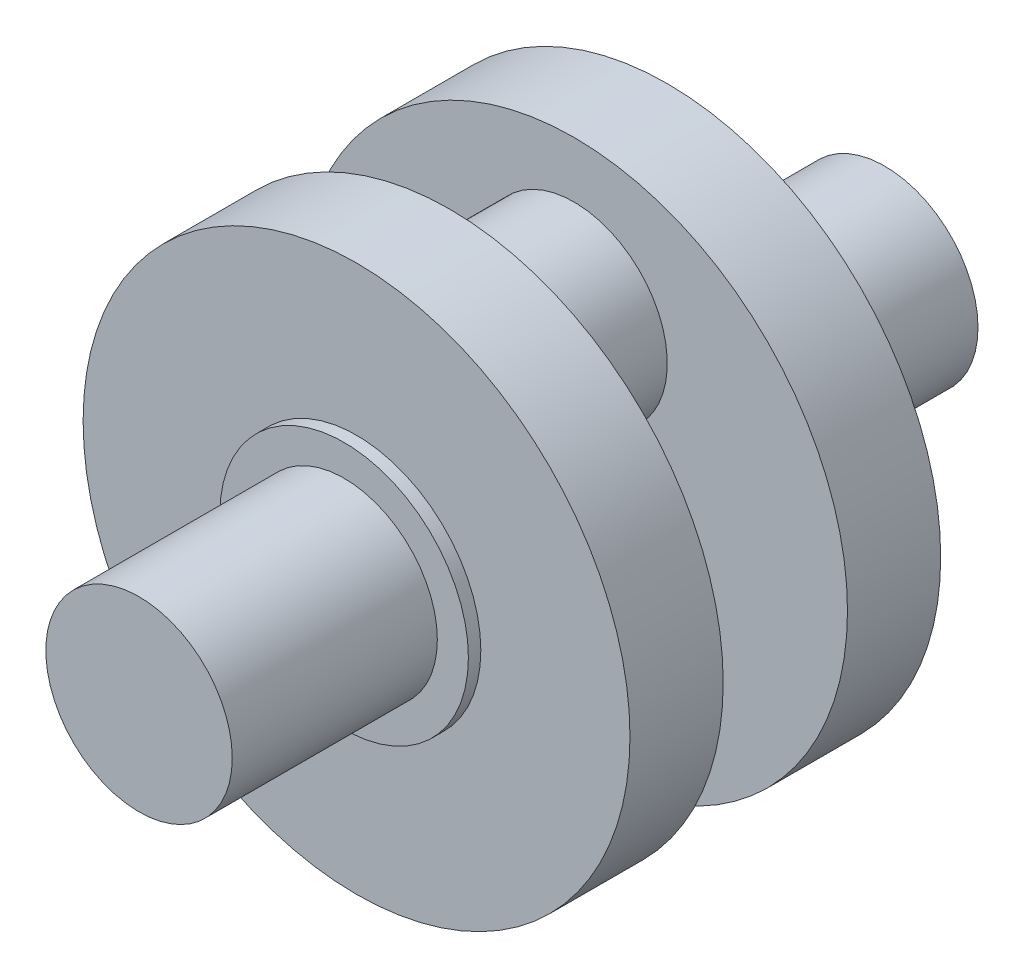
ISO-10303-21;
HEADER;
FILE_DESCRIPTION(('STEP AP214'),'2;1');
FILE_NAME('part.step','',(''),(''),'','','');
FILE_SCHEMA(('AUTOMOTIVE_DESIGN { 1 0 10303 214 1 1 1 1 }'));
ENDSEC;
DATA;
#1=APPLICATION_CONTEXT('core data for automotive mechanical design processes');
#2=APPLICATION_PROTOCOL_DEFINITION('international standard','automotive_design',2000,#1);
#3=PRODUCT_CONTEXT('',#1,'mechanical');
#4=PRODUCT('Part','Part','',(#3));
#5=PRODUCT_RELATED_PRODUCT_CATEGORY('part','',(#4));
#6=PRODUCT_DEFINITION_FORMATION('','',#4);
#7=PRODUCT_DEFINITION_CONTEXT('part definition',#1,'design');
#8=PRODUCT_DEFINITION('design','',#6,#7);
#9=PRODUCT_DEFINITION_SHAPE('','',#8);
#10=(LENGTH_UNIT() NAMED_UNIT(*) SI_UNIT(.MILLI.,.METRE.));
#11=(NAMED_UNIT(*) PLANE_ANGLE_UNIT() SI_UNIT($,.RADIAN.));
#12=(NAMED_UNIT(*) SI_UNIT($,.STERADIAN.) SOLID_ANGLE_UNIT());
#13=UNCERTAINTY_MEASURE_WITH_UNIT(LENGTH_MEASURE(1.E-05),#10,'distance_accuracy_value','');
#14=(GEOMETRIC_REPRESENTATION_CONTEXT(3) GLOBAL_UNCERTAINTY_ASSIGNED_CONTEXT((#13)) GLOBAL_UNIT_ASSIGNED_CONTEXT((#10,
#11,#12)) REPRESENTATION_CONTEXT('',''));
#15=CARTESIAN_POINT('',(0.,0.,0.));
#16=DIRECTION('',(0.,0.,1.));
#17=DIRECTION('',(1.,0.,0.));
#18=AXIS2_PLACEMENT_3D('',#15,#16,#17);
#19=CARTESIAN_POINT('',(0.,0.,33.));
#20=DIRECTION('',(0.,0.,-1.));
#21=DIRECTION('',(-1.,0.,0.));
#22=AXIS2_PLACEMENT_3D('',#19,#20,#21);
#23=CYLINDRICAL_SURFACE('',#22,15.);
#24=CARTESIAN_POINT('',(0.,0.,33.));
#25=DIRECTION('',(0.,0.,1.));
#26=DIRECTION('',(1.,0.,0.));
#27=AXIS2_PLACEMENT_3D('',#24,#25,#26);
#28=CIRCLE('',#27,15.);
#29=CARTESIAN_POINT('',(15.,0.,33.));
#30=VERTEX_POINT('',#29);
#31=EDGE_CURVE('E10',#30,#30,#28,.T.);
#32=ORIENTED_EDGE('',*,*,#31,.F.);
#33=EDGE_LOOP('',(#32));
#34=FACE_BOUND('',#33,.T.);
#35=CARTESIAN_POINT('',(0.,0.,0.));
#36=DIRECTION('',(0.,0.,1.));
#37=DIRECTION('',(1.,0.,0.));
#38=AXIS2_PLACEMENT_3D('',#35,#36,#37);
#39=CIRCLE('',#38,15.);
#40=CARTESIAN_POINT('',(15.,0.,0.));
#41=VERTEX_POINT('',#40);
#42=EDGE_CURVE('E44',#41,#41,#39,.T.);
#43=ORIENTED_EDGE('',*,*,#42,.T.);
#44=EDGE_LOOP('',(#43));
#45=FACE_BOUND('',#44,.T.);
#46=ADVANCED_FACE('F41',(#34,#45),#23,.T.);
#47=CARTESIAN_POINT('',(0.,0.,33.));
#48=DIRECTION('',(0.,0.,1.));
#49=DIRECTION('',(1.,0.,0.));
#50=AXIS2_PLACEMENT_3D('',#47,#48,#49);
#51=PLANE('',#50);
#52=ORIENTED_EDGE('',*,*,#31,.T.);
#53=EDGE_LOOP('',(#52));
#54=FACE_BOUND('',#53,.T.);
#55=ADVANCED_FACE('F124',(#54),#51,.T.);
#56=CARTESIAN_POINT('',(0.,0.,-2.));
#57=DIRECTION('',(0.,0.,1.));
#58=DIRECTION('',(1.,0.,0.));
#59=AXIS2_PLACEMENT_3D('',#56,#57,#58);
#60=CYLINDRICAL_SURFACE('',#59,20.);
#61=CARTESIAN_POINT('',(0.,0.,-2.));
#62=DIRECTION('',(0.,0.,1.));
#63=DIRECTION('',(1.,0.,0.));
#64=AXIS2_PLACEMENT_3D('',#61,#62,#63);
#65=CIRCLE('',#64,20.);
#66=CARTESIAN_POINT('',(20.,0.,-2.));
#67=VERTEX_POINT('',#66);
#68=EDGE_CURVE('E58',#67,#67,#65,.T.);
#69=ORIENTED_EDGE('',*,*,#68,.T.);
#70=EDGE_LOOP('',(#69));
#71=FACE_BOUND('',#70,.T.);
#72=CARTESIAN_POINT('',(0.,0.,0.));
#73=DIRECTION('',(0.,0.,1.));
#74=DIRECTION('',(1.,0.,0.));
#75=AXIS2_PLACEMENT_3D('',#72,#73,#74);
#76=CIRCLE('',#75,20.);
#77=CARTESIAN_POINT('',(20.,0.,0.));
#78=VERTEX_POINT('',#77);
#79=EDGE_CURVE('E53',#78,#78,#76,.T.);
#80=ORIENTED_EDGE('',*,*,#79,.F.);
#81=EDGE_LOOP('',(#80));
#82=FACE_BOUND('',#81,.T.);
#83=ADVANCED_FACE('F129',(#71,#82),#60,.T.);
#84=CARTESIAN_POINT('',(0.,0.,0.));
#85=DIRECTION('',(0.,0.,1.));
#86=DIRECTION('',(1.,0.,0.));
#87=AXIS2_PLACEMENT_3D('',#84,#85,#86);
#88=PLANE('',#87);
#89=ORIENTED_EDGE('',*,*,#42,.F.);
#90=EDGE_LOOP('',(#89));
#91=FACE_BOUND('',#90,.T.);
#92=ORIENTED_EDGE('',*,*,#79,.T.);
#93=EDGE_LOOP('',(#92));
#94=FACE_BOUND('',#93,.T.);
#95=ADVANCED_FACE('F133',(#91,#94),#88,.T.);
#96=CARTESIAN_POINT('',(0.,0.,-17.));
#97=DIRECTION('',(0.,0.,1.));
#98=DIRECTION('',(1.,0.,0.));
#99=AXIS2_PLACEMENT_3D('',#96,#97,#98);
#100=CYLINDRICAL_SURFACE('',#99,44.);
#101=CARTESIAN_POINT('',(0.,0.,-17.));
#102=DIRECTION('',(0.,0.,-1.));
#103=DIRECTION('',(-1.,0.,0.));
#104=AXIS2_PLACEMENT_3D('',#101,#102,#103);
#105=CIRCLE('',#104,44.);
#106=CARTESIAN_POINT('',(-44.,0.,-17.));
#107=VERTEX_POINT('',#106);
#108=EDGE_CURVE('E62',#107,#107,#105,.T.);
#109=ORIENTED_EDGE('',*,*,#108,.F.);
#110=EDGE_LOOP('',(#109));
#111=FACE_BOUND('',#110,.T.);
#112=CARTESIAN_POINT('',(0.,0.,-2.));
#113=DIRECTION('',(0.,0.,-1.));
#114=DIRECTION('',(-1.,0.,0.));
#115=AXIS2_PLACEMENT_3D('',#112,#113,#114);
#116=CIRCLE('',#115,44.);
#117=CARTESIAN_POINT('',(-44.,0.,-2.));
#118=VERTEX_POINT('',#117);
#119=EDGE_CURVE('E63',#118,#118,#116,.T.);
#120=ORIENTED_EDGE('',*,*,#119,.T.);
#121=EDGE_LOOP('',(#120));
#122=FACE_BOUND('',#121,.T.);
#123=ADVANCED_FACE('F136',(#111,#122),#100,.T.);
#124=CARTESIAN_POINT('',(0.,0.,-17.));
#125=DIRECTION('',(0.,0.,-1.));
#126=DIRECTION('',(-1.,0.,0.));
#127=AXIS2_PLACEMENT_3D('',#124,#125,#126);
#128=PLANE('',#127);
#129=CARTESIAN_POINT('',(0.,20.,-17.));
#130=DIRECTION('',(0.,0.,-1.));
#131=DIRECTION('',(-1.,0.,0.));
#132=AXIS2_PLACEMENT_3D('',#129,#130,#131);
#133=CIRCLE('',#132,15.);
#134=CARTESIAN_POINT('',(-15.,20.,-17.));
#135=VERTEX_POINT('',#134);
#136=EDGE_CURVE('E67',#135,#135,#133,.T.);
#137=ORIENTED_EDGE('',*,*,#136,.F.);
#138=EDGE_LOOP('',(#137));
#139=FACE_BOUND('',#138,.T.);
#140=ORIENTED_EDGE('',*,*,#108,.T.);
#141=EDGE_LOOP('',(#140));
#142=FACE_BOUND('',#141,.T.);
#143=ADVANCED_FACE('F119',(#139,#142),#128,.T.);
#144=CARTESIAN_POINT('',(0.,0.,-2.));
#145=DIRECTION('',(0.,0.,-1.));
#146=DIRECTION('',(-1.,0.,0.));
#147=AXIS2_PLACEMENT_3D('',#144,#145,#146);
#148=PLANE('',#147);
#149=ORIENTED_EDGE('',*,*,#68,.F.);
#150=EDGE_LOOP('',(#149));
#151=FACE_BOUND('',#150,.T.);
#152=ORIENTED_EDGE('',*,*,#119,.F.);
#153=EDGE_LOOP('',(#152));
#154=FACE_BOUND('',#153,.T.);
#155=ADVANCED_FACE('F109',(#151,#154),#148,.F.);
#156=CARTESIAN_POINT('',(0.,20.,-27.));
#157=DIRECTION('',(0.,0.,1.));
#158=DIRECTION('',(1.,0.,0.));
#159=AXIS2_PLACEMENT_3D('',#156,#157,#158);
#160=CYLINDRICAL_SURFACE('',#159,15.);
#161=ORIENTED_EDGE('',*,*,#136,.T.);
#162=EDGE_LOOP('',(#161));
#163=FACE_BOUND('',#162,.T.);
#164=CARTESIAN_POINT('',(0.,20.,-37.));
#165=DIRECTION('',(0.,0.,-1.));
#166=DIRECTION('',(-1.,0.,0.));
#167=AXIS2_PLACEMENT_3D('',#164,#165,#166);
#168=CIRCLE('',#167,15.);
#169=CARTESIAN_POINT('',(-15.,20.,-37.));
#170=VERTEX_POINT('',#169);
#171=EDGE_CURVE('E95',#170,#170,#168,.T.);
#172=ORIENTED_EDGE('',*,*,#171,.F.);
#173=EDGE_LOOP('',(#172));
#174=FACE_BOUND('',#173,.T.);
#175=ADVANCED_FACE('F106',(#163,#174),#160,.T.);
#176=CARTESIAN_POINT('',(0.,0.,-87.));
#177=DIRECTION('',(0.,0.,1.));
#178=DIRECTION('',(-1.,0.,0.));
#179=AXIS2_PLACEMENT_3D('',#176,#177,#178);
#180=CYLINDRICAL_SURFACE('',#179,15.);
#181=CARTESIAN_POINT('',(0.,0.,-87.));
#182=DIRECTION('',(0.,0.,1.));
#183=DIRECTION('',(1.,0.,0.));
#184=AXIS2_PLACEMENT_3D('',#181,#182,#183);
#185=CIRCLE('',#184,15.);
#186=CARTESIAN_POINT('',(15.,0.,-87.));
#187=VERTEX_POINT('',#186);
#188=EDGE_CURVE('E74',#187,#187,#185,.T.);
#189=ORIENTED_EDGE('',*,*,#188,.T.);
#190=EDGE_LOOP('',(#189));
#191=FACE_BOUND('',#190,.T.);
#192=CARTESIAN_POINT('',(0.,0.,-54.));
#193=DIRECTION('',(0.,0.,1.));
#194=DIRECTION('',(1.,0.,0.));
#195=AXIS2_PLACEMENT_3D('',#192,#193,#194);
#196=CIRCLE('',#195,15.);
#197=CARTESIAN_POINT('',(15.,0.,-54.));
#198=VERTEX_POINT('',#197);
#199=EDGE_CURVE('E75',#198,#198,#196,.T.);
#200=ORIENTED_EDGE('',*,*,#199,.F.);
#201=EDGE_LOOP('',(#200));
#202=FACE_BOUND('',#201,.T.);
#203=ADVANCED_FACE('F108',(#191,#202),#180,.T.);
#204=CARTESIAN_POINT('',(0.,0.,-87.));
#205=DIRECTION('',(0.,0.,-1.));
#206=DIRECTION('',(1.,0.,0.));
#207=AXIS2_PLACEMENT_3D('',#204,#205,#206);
#208=PLANE('',#207);
#209=ORIENTED_EDGE('',*,*,#188,.F.);
#210=EDGE_LOOP('',(#209));
#211=FACE_BOUND('',#210,.T.);
#212=ADVANCED_FACE('F116',(#211),#208,.T.);
#213=CARTESIAN_POINT('',(0.,0.,-52.));
#214=DIRECTION('',(0.,0.,-1.));
#215=DIRECTION('',(1.,0.,0.));
#216=AXIS2_PLACEMENT_3D('',#213,#214,#215);
#217=CYLINDRICAL_SURFACE('',#216,20.);
#218=CARTESIAN_POINT('',(0.,0.,-52.));
#219=DIRECTION('',(0.,0.,1.));
#220=DIRECTION('',(1.,0.,0.));
#221=AXIS2_PLACEMENT_3D('',#218,#219,#220);
#222=CIRCLE('',#221,20.);
#223=CARTESIAN_POINT('',(20.,0.,-52.));
#224=VERTEX_POINT('',#223);
#225=EDGE_CURVE('E86',#224,#224,#222,.T.);
#226=ORIENTED_EDGE('',*,*,#225,.F.);
#227=EDGE_LOOP('',(#226));
#228=FACE_BOUND('',#227,.T.);
#229=CARTESIAN_POINT('',(0.,0.,-54.));
#230=DIRECTION('',(0.,0.,1.));
#231=DIRECTION('',(1.,0.,0.));
#232=AXIS2_PLACEMENT_3D('',#229,#230,#231);
#233=CIRCLE('',#232,20.);
#234=CARTESIAN_POINT('',(20.,0.,-54.));
#235=VERTEX_POINT('',#234);
#236=EDGE_CURVE('E79',#235,#235,#233,.T.);
#237=ORIENTED_EDGE('',*,*,#236,.T.);
#238=EDGE_LOOP('',(#237));
#239=FACE_BOUND('',#238,.T.);
#240=ADVANCED_FACE('F208',(#228,#239),#217,.T.);
#241=CARTESIAN_POINT('',(0.,0.,-54.));
#242=DIRECTION('',(0.,0.,-1.));
#243=DIRECTION('',(1.,0.,0.));
#244=AXIS2_PLACEMENT_3D('',#241,#242,#243);
#245=PLANE('',#244);
#246=ORIENTED_EDGE('',*,*,#199,.T.);
#247=EDGE_LOOP('',(#246));
#248=FACE_BOUND('',#247,.T.);
#249=ORIENTED_EDGE('',*,*,#236,.F.);
#250=EDGE_LOOP('',(#249));
#251=FACE_BOUND('',#250,.T.);
#252=ADVANCED_FACE('F218',(#248,#251),#245,.T.);
#253=CARTESIAN_POINT('',(0.,0.,-37.));
#254=DIRECTION('',(0.,0.,-1.));
#255=DIRECTION('',(1.,0.,0.));
#256=AXIS2_PLACEMENT_3D('',#253,#254,#255);
#257=CYLINDRICAL_SURFACE('',#256,44.);
#258=CARTESIAN_POINT('',(0.,0.,-37.));
#259=DIRECTION('',(0.,0.,-1.));
#260=DIRECTION('',(-1.,0.,0.));
#261=AXIS2_PLACEMENT_3D('',#258,#259,#260);
#262=CIRCLE('',#261,44.);
#263=CARTESIAN_POINT('',(-44.,0.,-37.));
#264=VERTEX_POINT('',#263);
#265=EDGE_CURVE('E90',#264,#264,#262,.T.);
#266=ORIENTED_EDGE('',*,*,#265,.T.);
#267=EDGE_LOOP('',(#266));
#268=FACE_BOUND('',#267,.T.);
#269=CARTESIAN_POINT('',(0.,0.,-52.));
#270=DIRECTION('',(0.,0.,-1.));
#271=DIRECTION('',(-1.,0.,0.));
#272=AXIS2_PLACEMENT_3D('',#269,#270,#271);
#273=CIRCLE('',#272,44.);
#274=CARTESIAN_POINT('',(-44.,0.,-52.));
#275=VERTEX_POINT('',#274);
#276=EDGE_CURVE('E91',#275,#275,#273,.T.);
#277=ORIENTED_EDGE('',*,*,#276,.F.);
#278=EDGE_LOOP('',(#277));
#279=FACE_BOUND('',#278,.T.);
#280=ADVANCED_FACE('F228',(#268,#279),#257,.T.);
#281=CARTESIAN_POINT('',(0.,0.,-37.));
#282=DIRECTION('',(0.,0.,1.));
#283=DIRECTION('',(-1.,0.,0.));
#284=AXIS2_PLACEMENT_3D('',#281,#282,#283);
#285=PLANE('',#284);
#286=ORIENTED_EDGE('',*,*,#171,.T.);
#287=EDGE_LOOP('',(#286));
#288=FACE_BOUND('',#287,.T.);
#289=ORIENTED_EDGE('',*,*,#265,.F.);
#290=EDGE_LOOP('',(#289));
#291=FACE_BOUND('',#290,.T.);
#292=ADVANCED_FACE('F103',(#288,#291),#285,.T.);
#293=CARTESIAN_POINT('',(0.,0.,-52.));
#294=DIRECTION('',(0.,0.,1.));
#295=DIRECTION('',(-1.,0.,0.));
#296=AXIS2_PLACEMENT_3D('',#293,#294,#295);
#297=PLANE('',#296);
#298=ORIENTED_EDGE('',*,*,#225,.T.);
#299=EDGE_LOOP('',(#298));
#300=FACE_BOUND('',#299,.T.);
#301=ORIENTED_EDGE('',*,*,#276,.T.);
#302=EDGE_LOOP('',(#301));
#303=FACE_BOUND('',#302,.T.);
#304=ADVANCED_FACE('F247',(#300,#303),#297,.F.);
#305=CLOSED_SHELL('',(#46,#55,#83,#95,#123,#143,#155,#175,#203,#212,#240,#252,#280,#292,#304));
#306=MANIFOLD_SOLID_BREP('B2',#305);
#307=ADVANCED_BREP_SHAPE_REPRESENTATION('',(#18,#306),#14);
#308=SHAPE_DEFINITION_REPRESENTATION(#9,#307);
ENDSEC;
END-ISO-10303-21;
